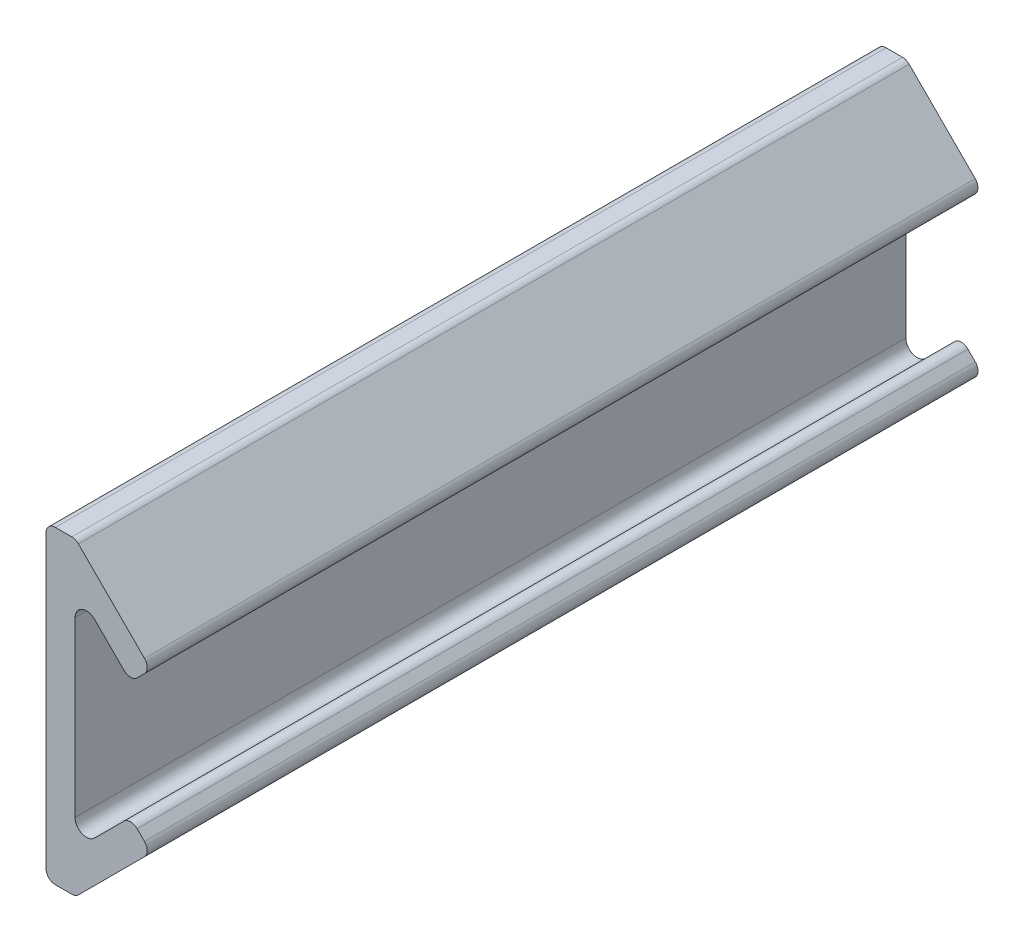
ISO-10303-21;
HEADER;
FILE_DESCRIPTION(('STEP AP214'),'2;1');
FILE_NAME('part.step','',(''),(''),'','','');
FILE_SCHEMA(('AUTOMOTIVE_DESIGN { 1 0 10303 214 1 1 1 1 }'));
ENDSEC;
DATA;
#1=APPLICATION_CONTEXT('core data for automotive mechanical design processes');
#2=APPLICATION_PROTOCOL_DEFINITION('international standard','automotive_design',2000,#1);
#3=PRODUCT_CONTEXT('',#1,'mechanical');
#4=PRODUCT('Part','Part','',(#3));
#5=PRODUCT_RELATED_PRODUCT_CATEGORY('part','',(#4));
#6=PRODUCT_DEFINITION_FORMATION('','',#4);
#7=PRODUCT_DEFINITION_CONTEXT('part definition',#1,'design');
#8=PRODUCT_DEFINITION('design','',#6,#7);
#9=PRODUCT_DEFINITION_SHAPE('','',#8);
#10=(LENGTH_UNIT() NAMED_UNIT(*) SI_UNIT(.MILLI.,.METRE.));
#11=(NAMED_UNIT(*) PLANE_ANGLE_UNIT() SI_UNIT($,.RADIAN.));
#12=(NAMED_UNIT(*) SI_UNIT($,.STERADIAN.) SOLID_ANGLE_UNIT());
#13=UNCERTAINTY_MEASURE_WITH_UNIT(LENGTH_MEASURE(1.E-05),#10,'distance_accuracy_value','');
#14=(GEOMETRIC_REPRESENTATION_CONTEXT(3) GLOBAL_UNCERTAINTY_ASSIGNED_CONTEXT((#13)) GLOBAL_UNIT_ASSIGNED_CONTEXT((#10,
#11,#12)) REPRESENTATION_CONTEXT('',''));
#15=CARTESIAN_POINT('',(0.,0.,0.));
#16=DIRECTION('',(0.,0.,1.));
#17=DIRECTION('',(1.,0.,0.));
#18=AXIS2_PLACEMENT_3D('',#15,#16,#17);
#19=CARTESIAN_POINT('',(2.5857864376269,-14.,80.));
#20=DIRECTION('',(0.,0.,-1.));
#21=DIRECTION('',(-1.,0.,0.));
#22=AXIS2_PLACEMENT_3D('',#19,#20,#21);
#23=CYLINDRICAL_SURFACE('',#22,0.899999999999999);
#24=CARTESIAN_POINT('',(2.5857864376269,-14.,0.));
#25=DIRECTION('',(0.,0.,1.));
#26=DIRECTION('',(1.,0.,0.));
#27=AXIS2_PLACEMENT_3D('',#24,#25,#26);
#28=CIRCLE('',#27,0.899999999999999);
#29=CARTESIAN_POINT('',(3.2221825406948,-14.6363961030679,0.));
#30=VERTEX_POINT('',#29);
#31=CARTESIAN_POINT('',(2.5857864376269,-14.9,0.));
#32=VERTEX_POINT('',#31);
#33=EDGE_CURVE('E204',#30,#32,#28,.F.);
#34=ORIENTED_EDGE('',*,*,#33,.F.);
#35=DIRECTION('',(0.,0.,-1.));
#36=VECTOR('',#35,1.);
#37=CARTESIAN_POINT('',(3.2221825406948,-14.6363961030679,80.));
#38=LINE('',#37,#36);
#39=CARTESIAN_POINT('',(3.2221825406948,-14.6363961030679,80.));
#40=VERTEX_POINT('',#39);
#41=EDGE_CURVE('E11',#40,#30,#38,.T.);
#42=ORIENTED_EDGE('',*,*,#41,.F.);
#43=CARTESIAN_POINT('',(2.5857864376269,-14.,80.));
#44=DIRECTION('',(0.,0.,1.));
#45=DIRECTION('',(1.,0.,0.));
#46=AXIS2_PLACEMENT_3D('',#43,#44,#45);
#47=CIRCLE('',#46,0.899999999999999);
#48=CARTESIAN_POINT('',(2.5857864376269,-14.9,80.));
#49=VERTEX_POINT('',#48);
#50=EDGE_CURVE('E255',#40,#49,#47,.F.);
#51=ORIENTED_EDGE('',*,*,#50,.T.);
#52=DIRECTION('',(0.,0.,-1.));
#53=VECTOR('',#52,1.);
#54=CARTESIAN_POINT('',(2.5857864376269,-14.9,80.));
#55=LINE('',#54,#53);
#56=EDGE_CURVE('E124',#49,#32,#55,.T.);
#57=ORIENTED_EDGE('',*,*,#56,.T.);
#58=EDGE_LOOP('',(#34,#42,#51,#57));
#59=FACE_BOUND('',#58,.T.);
#60=ADVANCED_FACE('F38',(#59),#23,.T.);
#61=CARTESIAN_POINT('',(8.92928932188135,-8.92928932188135,80.));
#62=DIRECTION('',(-0.707106781186547,0.707106781186548,0.));
#63=DIRECTION('',(-0.707106781186548,-0.707106781186547,0.));
#64=AXIS2_PLACEMENT_3D('',#61,#62,#63);
#65=PLANE('',#64);
#66=DIRECTION('',(0.707106781186548,0.707106781186547,0.));
#67=VECTOR('',#66,1.);
#68=CARTESIAN_POINT('',(8.92928932188135,-8.92928932188135,0.));
#69=LINE('',#68,#67);
#70=CARTESIAN_POINT('',(9.58614357137372,-8.27243507238897,0.));
#71=VERTEX_POINT('',#70);
#72=EDGE_CURVE('E207',#30,#71,#69,.T.);
#73=ORIENTED_EDGE('',*,*,#72,.T.);
#74=DIRECTION('',(0.,0.,-1.));
#75=VECTOR('',#74,1.);
#76=CARTESIAN_POINT('',(9.58614357137372,-8.27243507238897,80.));
#77=LINE('',#76,#75);
#78=CARTESIAN_POINT('',(9.58614357137372,-8.27243507238897,80.));
#79=VERTEX_POINT('',#78);
#80=EDGE_CURVE('E46',#79,#71,#77,.T.);
#81=ORIENTED_EDGE('',*,*,#80,.F.);
#82=DIRECTION('',(0.707106781186548,0.707106781186547,0.));
#83=VECTOR('',#82,1.);
#84=CARTESIAN_POINT('',(8.92928932188135,-8.92928932188135,80.));
#85=LINE('',#84,#83);
#86=EDGE_CURVE('E376',#40,#79,#85,.T.);
#87=ORIENTED_EDGE('',*,*,#86,.F.);
#88=ORIENTED_EDGE('',*,*,#41,.T.);
#89=EDGE_LOOP('',(#73,#81,#87,#88));
#90=FACE_BOUND('',#89,.T.);
#91=ADVANCED_FACE('F371',(#90),#65,.F.);
#92=CARTESIAN_POINT('',(8.94974746830583,-7.63603896932108,80.));
#93=DIRECTION('',(0.,0.,-1.));
#94=DIRECTION('',(-1.,0.,0.));
#95=AXIS2_PLACEMENT_3D('',#92,#93,#94);
#96=CYLINDRICAL_SURFACE('',#95,0.899999999999997);
#97=CARTESIAN_POINT('',(8.94974746830583,-7.63603896932108,0.));
#98=DIRECTION('',(0.,0.,1.));
#99=DIRECTION('',(1.,0.,0.));
#100=AXIS2_PLACEMENT_3D('',#97,#98,#99);
#101=CIRCLE('',#100,0.899999999999997);
#102=CARTESIAN_POINT('',(9.58614357137373,-6.99964286625319,0.));
#103=VERTEX_POINT('',#102);
#104=EDGE_CURVE('E209',#71,#103,#101,.T.);
#105=ORIENTED_EDGE('',*,*,#104,.T.);
#106=DIRECTION('',(0.,0.,-1.));
#107=VECTOR('',#106,1.);
#108=CARTESIAN_POINT('',(9.58614357137373,-6.99964286625319,80.));
#109=LINE('',#108,#107);
#110=CARTESIAN_POINT('',(9.58614357137373,-6.99964286625319,80.));
#111=VERTEX_POINT('',#110);
#112=EDGE_CURVE('E288',#111,#103,#109,.T.);
#113=ORIENTED_EDGE('',*,*,#112,.F.);
#114=CARTESIAN_POINT('',(8.94974746830583,-7.63603896932108,80.));
#115=DIRECTION('',(0.,0.,1.));
#116=DIRECTION('',(1.,0.,0.));
#117=AXIS2_PLACEMENT_3D('',#114,#115,#116);
#118=CIRCLE('',#117,0.899999999999997);
#119=EDGE_CURVE('E297',#79,#111,#118,.T.);
#120=ORIENTED_EDGE('',*,*,#119,.F.);
#121=ORIENTED_EDGE('',*,*,#80,.T.);
#122=EDGE_LOOP('',(#105,#113,#120,#121));
#123=FACE_BOUND('',#122,.T.);
#124=ADVANCED_FACE('F295',(#123),#96,.T.);
#125=CARTESIAN_POINT('',(1.29325035256027,1.29325035256027,80.));
#126=DIRECTION('',(-0.707106781186548,-0.707106781186548,0.));
#127=DIRECTION('',(0.707106781186548,-0.707106781186548,0.));
#128=AXIS2_PLACEMENT_3D('',#125,#126,#127);
#129=PLANE('',#128);
#130=DIRECTION('',(-0.707106781186548,0.707106781186548,0.));
#131=VECTOR('',#130,1.);
#132=CARTESIAN_POINT('',(1.29325035256027,1.29325035256027,0.));
#133=LINE('',#132,#131);
#134=CARTESIAN_POINT('',(8.87903679018718,-6.29253608506664,0.));
#135=VERTEX_POINT('',#134);
#136=EDGE_CURVE('E211',#103,#135,#133,.T.);
#137=ORIENTED_EDGE('',*,*,#136,.T.);
#138=DIRECTION('',(0.,0.,-1.));
#139=VECTOR('',#138,1.);
#140=CARTESIAN_POINT('',(8.87903679018718,-6.29253608506664,80.));
#141=LINE('',#140,#139);
#142=CARTESIAN_POINT('',(8.87903679018718,-6.29253608506664,80.));
#143=VERTEX_POINT('',#142);
#144=EDGE_CURVE('E285',#143,#135,#141,.T.);
#145=ORIENTED_EDGE('',*,*,#144,.F.);
#146=DIRECTION('',(-0.707106781186548,0.707106781186548,0.));
#147=VECTOR('',#146,1.);
#148=CARTESIAN_POINT('',(1.29325035256027,1.29325035256027,80.));
#149=LINE('',#148,#147);
#150=EDGE_CURVE('E316',#111,#143,#149,.T.);
#151=ORIENTED_EDGE('',*,*,#150,.F.);
#152=ORIENTED_EDGE('',*,*,#112,.T.);
#153=EDGE_LOOP('',(#137,#145,#151,#152));
#154=FACE_BOUND('',#153,.T.);
#155=ADVANCED_FACE('F307',(#154),#129,.F.);
#156=CARTESIAN_POINT('',(8.24264068711929,-6.92893218813453,80.));
#157=DIRECTION('',(0.,0.,-1.));
#158=DIRECTION('',(-1.,0.,0.));
#159=AXIS2_PLACEMENT_3D('',#156,#157,#158);
#160=CYLINDRICAL_SURFACE('',#159,0.900000000000001);
#161=CARTESIAN_POINT('',(8.24264068711929,-6.92893218813453,0.));
#162=DIRECTION('',(0.,0.,1.));
#163=DIRECTION('',(1.,0.,0.));
#164=AXIS2_PLACEMENT_3D('',#161,#162,#163);
#165=CIRCLE('',#164,0.900000000000001);
#166=CARTESIAN_POINT('',(7.60624458405139,-6.29253608506664,0.));
#167=VERTEX_POINT('',#166);
#168=EDGE_CURVE('E213',#135,#167,#165,.T.);
#169=ORIENTED_EDGE('',*,*,#168,.T.);
#170=DIRECTION('',(0.,0.,-1.));
#171=VECTOR('',#170,1.);
#172=CARTESIAN_POINT('',(7.60624458405139,-6.29253608506664,80.));
#173=LINE('',#172,#171);
#174=CARTESIAN_POINT('',(7.60624458405139,-6.29253608506664,80.));
#175=VERTEX_POINT('',#174);
#176=EDGE_CURVE('E282',#175,#167,#173,.T.);
#177=ORIENTED_EDGE('',*,*,#176,.F.);
#178=CARTESIAN_POINT('',(8.24264068711929,-6.92893218813453,80.));
#179=DIRECTION('',(0.,0.,1.));
#180=DIRECTION('',(1.,0.,0.));
#181=AXIS2_PLACEMENT_3D('',#178,#179,#180);
#182=CIRCLE('',#181,0.900000000000001);
#183=EDGE_CURVE('E313',#143,#175,#182,.T.);
#184=ORIENTED_EDGE('',*,*,#183,.F.);
#185=ORIENTED_EDGE('',*,*,#144,.T.);
#186=EDGE_LOOP('',(#169,#177,#184,#185));
#187=FACE_BOUND('',#186,.T.);
#188=ADVANCED_FACE('F311',(#187),#160,.T.);
#189=CARTESIAN_POINT('',(6.94939033455902,-6.94939033455902,80.));
#190=DIRECTION('',(0.707106781186548,-0.707106781186547,0.));
#191=DIRECTION('',(0.707106781186547,0.707106781186548,0.));
#192=AXIS2_PLACEMENT_3D('',#189,#190,#191);
#193=PLANE('',#192);
#194=DIRECTION('',(-0.707106781186547,-0.707106781186548,0.));
#195=VECTOR('',#194,1.);
#196=CARTESIAN_POINT('',(6.94939033455902,-6.94939033455902,0.));
#197=LINE('',#196,#195);
#198=CARTESIAN_POINT('',(4.77781745930521,-9.12096320981283,0.));
#199=VERTEX_POINT('',#198);
#200=EDGE_CURVE('E215',#167,#199,#197,.T.);
#201=ORIENTED_EDGE('',*,*,#200,.T.);
#202=DIRECTION('',(0.,0.,-1.));
#203=VECTOR('',#202,1.);
#204=CARTESIAN_POINT('',(4.77781745930521,-9.12096320981283,80.));
#205=LINE('',#204,#203);
#206=CARTESIAN_POINT('',(4.77781745930521,-9.12096320981283,80.));
#207=VERTEX_POINT('',#206);
#208=EDGE_CURVE('E280',#207,#199,#205,.T.);
#209=ORIENTED_EDGE('',*,*,#208,.F.);
#210=DIRECTION('',(-0.707106781186547,-0.707106781186548,0.));
#211=VECTOR('',#210,1.);
#212=CARTESIAN_POINT('',(6.94939033455902,-6.94939033455902,80.));
#213=LINE('',#212,#211);
#214=EDGE_CURVE('E315',#175,#207,#213,.T.);
#215=ORIENTED_EDGE('',*,*,#214,.F.);
#216=ORIENTED_EDGE('',*,*,#176,.T.);
#217=EDGE_LOOP('',(#201,#209,#215,#216));
#218=FACE_BOUND('',#217,.T.);
#219=ADVANCED_FACE('F524',(#218),#193,.F.);
#220=CARTESIAN_POINT('',(4.,-8.34314575050762,80.));
#221=DIRECTION('',(0.,0.,-1.));
#222=DIRECTION('',(-1.,0.,0.));
#223=AXIS2_PLACEMENT_3D('',#220,#221,#222);
#224=CYLINDRICAL_SURFACE('',#223,1.1);
#225=CARTESIAN_POINT('',(4.,-8.34314575050762,0.));
#226=DIRECTION('',(0.,0.,1.));
#227=DIRECTION('',(1.,0.,0.));
#228=AXIS2_PLACEMENT_3D('',#225,#226,#227);
#229=CIRCLE('',#228,1.1);
#230=CARTESIAN_POINT('',(2.9,-8.34314575050762,0.));
#231=VERTEX_POINT('',#230);
#232=EDGE_CURVE('E218',#231,#199,#229,.T.);
#233=ORIENTED_EDGE('',*,*,#232,.F.);
#234=DIRECTION('',(0.,0.,-1.));
#235=VECTOR('',#234,1.);
#236=CARTESIAN_POINT('',(2.9,-8.34314575050762,80.));
#237=LINE('',#236,#235);
#238=CARTESIAN_POINT('',(2.9,-8.34314575050762,80.));
#239=VERTEX_POINT('',#238);
#240=EDGE_CURVE('E278',#239,#231,#237,.T.);
#241=ORIENTED_EDGE('',*,*,#240,.F.);
#242=CARTESIAN_POINT('',(4.,-8.34314575050762,80.));
#243=DIRECTION('',(0.,0.,1.));
#244=DIRECTION('',(1.,0.,0.));
#245=AXIS2_PLACEMENT_3D('',#242,#243,#244);
#246=CIRCLE('',#245,1.1);
#247=EDGE_CURVE('E318',#239,#207,#246,.T.);
#248=ORIENTED_EDGE('',*,*,#247,.T.);
#249=ORIENTED_EDGE('',*,*,#208,.T.);
#250=EDGE_LOOP('',(#233,#241,#248,#249));
#251=FACE_BOUND('',#250,.T.);
#252=ADVANCED_FACE('F513',(#251),#224,.F.);
#253=CARTESIAN_POINT('',(2.9,0.,80.));
#254=DIRECTION('',(-1.,0.,0.));
#255=DIRECTION('',(0.,-1.,0.));
#256=AXIS2_PLACEMENT_3D('',#253,#254,#255);
#257=PLANE('',#256);
#258=DIRECTION('',(0.,1.,0.));
#259=VECTOR('',#258,1.);
#260=CARTESIAN_POINT('',(2.9,0.,0.));
#261=LINE('',#260,#259);
#262=CARTESIAN_POINT('',(2.9,8.34314575050762,0.));
#263=VERTEX_POINT('',#262);
#264=EDGE_CURVE('E221',#231,#263,#261,.T.);
#265=ORIENTED_EDGE('',*,*,#264,.T.);
#266=DIRECTION('',(0.,0.,-1.));
#267=VECTOR('',#266,1.);
#268=CARTESIAN_POINT('',(2.9,8.34314575050762,80.));
#269=LINE('',#268,#267);
#270=CARTESIAN_POINT('',(2.9,8.34314575050762,80.));
#271=VERTEX_POINT('',#270);
#272=EDGE_CURVE('E275',#271,#263,#269,.T.);
#273=ORIENTED_EDGE('',*,*,#272,.F.);
#274=DIRECTION('',(0.,1.,0.));
#275=VECTOR('',#274,1.);
#276=CARTESIAN_POINT('',(2.9,0.,80.));
#277=LINE('',#276,#275);
#278=EDGE_CURVE('E325',#239,#271,#277,.T.);
#279=ORIENTED_EDGE('',*,*,#278,.F.);
#280=ORIENTED_EDGE('',*,*,#240,.T.);
#281=EDGE_LOOP('',(#265,#273,#279,#280));
#282=FACE_BOUND('',#281,.T.);
#283=ADVANCED_FACE('F502',(#282),#257,.F.);
#284=CARTESIAN_POINT('',(4.,8.34314575050762,80.));
#285=DIRECTION('',(0.,0.,-1.));
#286=DIRECTION('',(-1.,0.,0.));
#287=AXIS2_PLACEMENT_3D('',#284,#285,#286);
#288=CYLINDRICAL_SURFACE('',#287,1.1);
#289=CARTESIAN_POINT('',(4.,8.34314575050762,0.));
#290=DIRECTION('',(0.,0.,1.));
#291=DIRECTION('',(1.,0.,0.));
#292=AXIS2_PLACEMENT_3D('',#289,#290,#291);
#293=CIRCLE('',#292,1.1);
#294=CARTESIAN_POINT('',(4.7778174593052,9.12096320981283,0.));
#295=VERTEX_POINT('',#294);
#296=EDGE_CURVE('E223',#263,#295,#293,.F.);
#297=ORIENTED_EDGE('',*,*,#296,.T.);
#298=DIRECTION('',(0.,0.,-1.));
#299=VECTOR('',#298,1.);
#300=CARTESIAN_POINT('',(4.7778174593052,9.12096320981283,80.));
#301=LINE('',#300,#299);
#302=CARTESIAN_POINT('',(4.7778174593052,9.12096320981283,80.));
#303=VERTEX_POINT('',#302);
#304=EDGE_CURVE('E273',#303,#295,#301,.T.);
#305=ORIENTED_EDGE('',*,*,#304,.F.);
#306=CARTESIAN_POINT('',(4.,8.34314575050762,80.));
#307=DIRECTION('',(0.,0.,1.));
#308=DIRECTION('',(1.,0.,0.));
#309=AXIS2_PLACEMENT_3D('',#306,#307,#308);
#310=CIRCLE('',#309,1.1);
#311=EDGE_CURVE('E327',#271,#303,#310,.F.);
#312=ORIENTED_EDGE('',*,*,#311,.F.);
#313=ORIENTED_EDGE('',*,*,#272,.T.);
#314=EDGE_LOOP('',(#297,#305,#312,#313));
#315=FACE_BOUND('',#314,.T.);
#316=ADVANCED_FACE('F491',(#315),#288,.F.);
#317=CARTESIAN_POINT('',(6.94939033455901,6.94939033455902,80.));
#318=DIRECTION('',(-0.707106781186547,-0.707106781186548,0.));
#319=DIRECTION('',(0.707106781186548,-0.707106781186547,0.));
#320=AXIS2_PLACEMENT_3D('',#317,#318,#319);
#321=PLANE('',#320);
#322=DIRECTION('',(-0.707106781186548,0.707106781186547,0.));
#323=VECTOR('',#322,1.);
#324=CARTESIAN_POINT('',(6.94939033455901,6.94939033455902,0.));
#325=LINE('',#324,#323);
#326=CARTESIAN_POINT('',(7.60624458405139,6.29253608506664,0.));
#327=VERTEX_POINT('',#326);
#328=EDGE_CURVE('E226',#327,#295,#325,.T.);
#329=ORIENTED_EDGE('',*,*,#328,.F.);
#330=DIRECTION('',(0.,0.,-1.));
#331=VECTOR('',#330,1.);
#332=CARTESIAN_POINT('',(7.60624458405139,6.29253608506664,80.));
#333=LINE('',#332,#331);
#334=CARTESIAN_POINT('',(7.60624458405139,6.29253608506664,80.));
#335=VERTEX_POINT('',#334);
#336=EDGE_CURVE('E271',#335,#327,#333,.T.);
#337=ORIENTED_EDGE('',*,*,#336,.F.);
#338=DIRECTION('',(-0.707106781186548,0.707106781186547,0.));
#339=VECTOR('',#338,1.);
#340=CARTESIAN_POINT('',(6.94939033455901,6.94939033455902,80.));
#341=LINE('',#340,#339);
#342=EDGE_CURVE('E329',#335,#303,#341,.T.);
#343=ORIENTED_EDGE('',*,*,#342,.T.);
#344=ORIENTED_EDGE('',*,*,#304,.T.);
#345=EDGE_LOOP('',(#329,#337,#343,#344));
#346=FACE_BOUND('',#345,.T.);
#347=ADVANCED_FACE('F480',(#346),#321,.T.);
#348=CARTESIAN_POINT('',(8.24264068711929,6.92893218813453,80.));
#349=DIRECTION('',(0.,0.,-1.));
#350=DIRECTION('',(-1.,0.,0.));
#351=AXIS2_PLACEMENT_3D('',#348,#349,#350);
#352=CYLINDRICAL_SURFACE('',#351,0.900000000000001);
#353=CARTESIAN_POINT('',(8.24264068711929,6.92893218813453,0.));
#354=DIRECTION('',(0.,0.,1.));
#355=DIRECTION('',(1.,0.,0.));
#356=AXIS2_PLACEMENT_3D('',#353,#354,#355);
#357=CIRCLE('',#356,0.900000000000001);
#358=CARTESIAN_POINT('',(8.87903679018718,6.29253608506664,0.));
#359=VERTEX_POINT('',#358);
#360=EDGE_CURVE('E229',#359,#327,#357,.F.);
#361=ORIENTED_EDGE('',*,*,#360,.F.);
#362=DIRECTION('',(0.,0.,-1.));
#363=VECTOR('',#362,1.);
#364=CARTESIAN_POINT('',(8.87903679018718,6.29253608506664,80.));
#365=LINE('',#364,#363);
#366=CARTESIAN_POINT('',(8.87903679018718,6.29253608506664,80.));
#367=VERTEX_POINT('',#366);
#368=EDGE_CURVE('E269',#367,#359,#365,.T.);
#369=ORIENTED_EDGE('',*,*,#368,.F.);
#370=CARTESIAN_POINT('',(8.24264068711929,6.92893218813453,80.));
#371=DIRECTION('',(0.,0.,1.));
#372=DIRECTION('',(1.,0.,0.));
#373=AXIS2_PLACEMENT_3D('',#370,#371,#372);
#374=CIRCLE('',#373,0.900000000000001);
#375=EDGE_CURVE('E332',#367,#335,#374,.F.);
#376=ORIENTED_EDGE('',*,*,#375,.T.);
#377=ORIENTED_EDGE('',*,*,#336,.T.);
#378=EDGE_LOOP('',(#361,#369,#376,#377));
#379=FACE_BOUND('',#378,.T.);
#380=ADVANCED_FACE('F469',(#379),#352,.T.);
#381=CARTESIAN_POINT('',(1.29325035256028,-1.29325035256028,80.));
#382=DIRECTION('',(0.707106781186548,-0.707106781186547,0.));
#383=DIRECTION('',(0.707106781186547,0.707106781186548,0.));
#384=AXIS2_PLACEMENT_3D('',#381,#382,#383);
#385=PLANE('',#384);
#386=DIRECTION('',(-0.707106781186547,-0.707106781186548,0.));
#387=VECTOR('',#386,1.);
#388=CARTESIAN_POINT('',(1.29325035256028,-1.29325035256028,0.));
#389=LINE('',#388,#387);
#390=CARTESIAN_POINT('',(9.58614357137373,6.99964286625319,0.));
#391=VERTEX_POINT('',#390);
#392=EDGE_CURVE('E232',#391,#359,#389,.T.);
#393=ORIENTED_EDGE('',*,*,#392,.F.);
#394=DIRECTION('',(0.,0.,-1.));
#395=VECTOR('',#394,1.);
#396=CARTESIAN_POINT('',(9.58614357137373,6.99964286625319,80.));
#397=LINE('',#396,#395);
#398=CARTESIAN_POINT('',(9.58614357137373,6.99964286625319,80.));
#399=VERTEX_POINT('',#398);
#400=EDGE_CURVE('E267',#399,#391,#397,.T.);
#401=ORIENTED_EDGE('',*,*,#400,.F.);
#402=DIRECTION('',(-0.707106781186547,-0.707106781186548,0.));
#403=VECTOR('',#402,1.);
#404=CARTESIAN_POINT('',(1.29325035256028,-1.29325035256028,80.));
#405=LINE('',#404,#403);
#406=EDGE_CURVE('E335',#399,#367,#405,.T.);
#407=ORIENTED_EDGE('',*,*,#406,.T.);
#408=ORIENTED_EDGE('',*,*,#368,.T.);
#409=EDGE_LOOP('',(#393,#401,#407,#408));
#410=FACE_BOUND('',#409,.T.);
#411=ADVANCED_FACE('F458',(#410),#385,.T.);
#412=CARTESIAN_POINT('',(8.94974746830583,7.63603896932108,80.));
#413=DIRECTION('',(0.,0.,-1.));
#414=DIRECTION('',(-1.,0.,0.));
#415=AXIS2_PLACEMENT_3D('',#412,#413,#414);
#416=CYLINDRICAL_SURFACE('',#415,0.9);
#417=CARTESIAN_POINT('',(8.94974746830583,7.63603896932108,0.));
#418=DIRECTION('',(0.,0.,1.));
#419=DIRECTION('',(1.,0.,0.));
#420=AXIS2_PLACEMENT_3D('',#417,#418,#419);
#421=CIRCLE('',#420,0.9);
#422=CARTESIAN_POINT('',(9.58614357137373,8.27243507238897,0.));
#423=VERTEX_POINT('',#422);
#424=EDGE_CURVE('E235',#423,#391,#421,.F.);
#425=ORIENTED_EDGE('',*,*,#424,.F.);
#426=DIRECTION('',(0.,0.,-1.));
#427=VECTOR('',#426,1.);
#428=CARTESIAN_POINT('',(9.58614357137373,8.27243507238897,80.));
#429=LINE('',#428,#427);
#430=CARTESIAN_POINT('',(9.58614357137373,8.27243507238897,80.));
#431=VERTEX_POINT('',#430);
#432=EDGE_CURVE('E265',#431,#423,#429,.T.);
#433=ORIENTED_EDGE('',*,*,#432,.F.);
#434=CARTESIAN_POINT('',(8.94974746830583,7.63603896932108,80.));
#435=DIRECTION('',(0.,0.,1.));
#436=DIRECTION('',(1.,0.,0.));
#437=AXIS2_PLACEMENT_3D('',#434,#435,#436);
#438=CIRCLE('',#437,0.9);
#439=EDGE_CURVE('E338',#431,#399,#438,.F.);
#440=ORIENTED_EDGE('',*,*,#439,.T.);
#441=ORIENTED_EDGE('',*,*,#400,.T.);
#442=EDGE_LOOP('',(#425,#433,#440,#441));
#443=FACE_BOUND('',#442,.T.);
#444=ADVANCED_FACE('F447',(#443),#416,.T.);
#445=CARTESIAN_POINT('',(8.92928932188134,8.92928932188136,80.));
#446=DIRECTION('',(0.707106781186547,0.707106781186548,0.));
#447=DIRECTION('',(-0.707106781186548,0.707106781186547,0.));
#448=AXIS2_PLACEMENT_3D('',#445,#446,#447);
#449=PLANE('',#448);
#450=DIRECTION('',(0.707106781186548,-0.707106781186547,0.));
#451=VECTOR('',#450,1.);
#452=CARTESIAN_POINT('',(8.92928932188134,8.92928932188136,0.));
#453=LINE('',#452,#451);
#454=CARTESIAN_POINT('',(3.2221825406948,14.6363961030679,0.));
#455=VERTEX_POINT('',#454);
#456=EDGE_CURVE('E238',#455,#423,#453,.T.);
#457=ORIENTED_EDGE('',*,*,#456,.F.);
#458=DIRECTION('',(0.,0.,-1.));
#459=VECTOR('',#458,1.);
#460=CARTESIAN_POINT('',(3.2221825406948,14.6363961030679,80.));
#461=LINE('',#460,#459);
#462=CARTESIAN_POINT('',(3.2221825406948,14.6363961030679,80.));
#463=VERTEX_POINT('',#462);
#464=EDGE_CURVE('E263',#463,#455,#461,.T.);
#465=ORIENTED_EDGE('',*,*,#464,.F.);
#466=DIRECTION('',(0.707106781186548,-0.707106781186547,0.));
#467=VECTOR('',#466,1.);
#468=CARTESIAN_POINT('',(8.92928932188134,8.92928932188136,80.));
#469=LINE('',#468,#467);
#470=EDGE_CURVE('E341',#463,#431,#469,.T.);
#471=ORIENTED_EDGE('',*,*,#470,.T.);
#472=ORIENTED_EDGE('',*,*,#432,.T.);
#473=EDGE_LOOP('',(#457,#465,#471,#472));
#474=FACE_BOUND('',#473,.T.);
#475=ADVANCED_FACE('F437',(#474),#449,.T.);
#476=CARTESIAN_POINT('',(2.5857864376269,14.,80.));
#477=DIRECTION('',(0.,0.,-1.));
#478=DIRECTION('',(-1.,0.,0.));
#479=AXIS2_PLACEMENT_3D('',#476,#477,#478);
#480=CYLINDRICAL_SURFACE('',#479,0.899999999999999);
#481=CARTESIAN_POINT('',(2.5857864376269,14.,0.));
#482=DIRECTION('',(0.,0.,1.));
#483=DIRECTION('',(1.,0.,0.));
#484=AXIS2_PLACEMENT_3D('',#481,#482,#483);
#485=CIRCLE('',#484,0.899999999999999);
#486=CARTESIAN_POINT('',(2.5857864376269,14.9,0.));
#487=VERTEX_POINT('',#486);
#488=EDGE_CURVE('E241',#455,#487,#485,.T.);
#489=ORIENTED_EDGE('',*,*,#488,.T.);
#490=DIRECTION('',(0.,0.,-1.));
#491=VECTOR('',#490,1.);
#492=CARTESIAN_POINT('',(2.5857864376269,14.9,80.));
#493=LINE('',#492,#491);
#494=CARTESIAN_POINT('',(2.5857864376269,14.9,80.));
#495=VERTEX_POINT('',#494);
#496=EDGE_CURVE('E261',#495,#487,#493,.T.);
#497=ORIENTED_EDGE('',*,*,#496,.F.);
#498=CARTESIAN_POINT('',(2.5857864376269,14.,80.));
#499=DIRECTION('',(0.,0.,1.));
#500=DIRECTION('',(1.,0.,0.));
#501=AXIS2_PLACEMENT_3D('',#498,#499,#500);
#502=CIRCLE('',#501,0.899999999999999);
#503=EDGE_CURVE('E344',#463,#495,#502,.T.);
#504=ORIENTED_EDGE('',*,*,#503,.F.);
#505=ORIENTED_EDGE('',*,*,#464,.T.);
#506=EDGE_LOOP('',(#489,#497,#504,#505));
#507=FACE_BOUND('',#506,.T.);
#508=ADVANCED_FACE('F356',(#507),#480,.T.);
#509=CARTESIAN_POINT('',(0.,14.9,80.));
#510=DIRECTION('',(0.,1.,0.));
#511=DIRECTION('',(0.,0.,1.));
#512=AXIS2_PLACEMENT_3D('',#509,#510,#511);
#513=PLANE('',#512);
#514=DIRECTION('',(1.,0.,0.));
#515=VECTOR('',#514,1.);
#516=CARTESIAN_POINT('',(0.,14.9,0.));
#517=LINE('',#516,#515);
#518=CARTESIAN_POINT('',(1.00000000000001,14.9,0.));
#519=VERTEX_POINT('',#518);
#520=EDGE_CURVE('E244',#519,#487,#517,.T.);
#521=ORIENTED_EDGE('',*,*,#520,.F.);
#522=DIRECTION('',(0.,0.,-1.));
#523=VECTOR('',#522,1.);
#524=CARTESIAN_POINT('',(1.00000000000001,14.9,80.));
#525=LINE('',#524,#523);
#526=CARTESIAN_POINT('',(1.00000000000001,14.9,80.));
#527=VERTEX_POINT('',#526);
#528=EDGE_CURVE('E259',#527,#519,#525,.T.);
#529=ORIENTED_EDGE('',*,*,#528,.F.);
#530=DIRECTION('',(1.,0.,0.));
#531=VECTOR('',#530,1.);
#532=CARTESIAN_POINT('',(0.,14.9,80.));
#533=LINE('',#532,#531);
#534=EDGE_CURVE('E346',#527,#495,#533,.T.);
#535=ORIENTED_EDGE('',*,*,#534,.T.);
#536=ORIENTED_EDGE('',*,*,#496,.T.);
#537=EDGE_LOOP('',(#521,#529,#535,#536));
#538=FACE_BOUND('',#537,.T.);
#539=ADVANCED_FACE('F350',(#538),#513,.T.);
#540=CARTESIAN_POINT('',(1.,14.,80.));
#541=DIRECTION('',(0.,0.,-1.));
#542=DIRECTION('',(-1.,0.,0.));
#543=AXIS2_PLACEMENT_3D('',#540,#541,#542);
#544=CYLINDRICAL_SURFACE('',#543,0.9);
#545=CARTESIAN_POINT('',(1.,14.,0.));
#546=DIRECTION('',(0.,0.,1.));
#547=DIRECTION('',(1.,0.,0.));
#548=AXIS2_PLACEMENT_3D('',#545,#546,#547);
#549=CIRCLE('',#548,0.9);
#550=CARTESIAN_POINT('',(0.1,14.,0.));
#551=VERTEX_POINT('',#550);
#552=EDGE_CURVE('E247',#519,#551,#549,.T.);
#553=ORIENTED_EDGE('',*,*,#552,.T.);
#554=DIRECTION('',(0.,0.,-1.));
#555=VECTOR('',#554,1.);
#556=CARTESIAN_POINT('',(0.1,14.,80.));
#557=LINE('',#556,#555);
#558=CARTESIAN_POINT('',(0.1,14.,80.));
#559=VERTEX_POINT('',#558);
#560=EDGE_CURVE('E190',#559,#551,#557,.T.);
#561=ORIENTED_EDGE('',*,*,#560,.F.);
#562=CARTESIAN_POINT('',(1.,14.,80.));
#563=DIRECTION('',(0.,0.,1.));
#564=DIRECTION('',(1.,0.,0.));
#565=AXIS2_PLACEMENT_3D('',#562,#563,#564);
#566=CIRCLE('',#565,0.9);
#567=EDGE_CURVE('E196',#527,#559,#566,.T.);
#568=ORIENTED_EDGE('',*,*,#567,.F.);
#569=ORIENTED_EDGE('',*,*,#528,.T.);
#570=EDGE_LOOP('',(#553,#561,#568,#569));
#571=FACE_BOUND('',#570,.T.);
#572=ADVANCED_FACE('F361',(#571),#544,.T.);
#573=CARTESIAN_POINT('',(0.1,0.,80.));
#574=DIRECTION('',(-1.,0.,0.));
#575=DIRECTION('',(0.,-1.,0.));
#576=AXIS2_PLACEMENT_3D('',#573,#574,#575);
#577=PLANE('',#576);
#578=DIRECTION('',(0.,1.,0.));
#579=VECTOR('',#578,1.);
#580=CARTESIAN_POINT('',(0.1,0.,0.));
#581=LINE('',#580,#579);
#582=CARTESIAN_POINT('',(0.1,-14.,0.));
#583=VERTEX_POINT('',#582);
#584=EDGE_CURVE('E185',#583,#551,#581,.T.);
#585=ORIENTED_EDGE('',*,*,#584,.F.);
#586=DIRECTION('',(0.,0.,-1.));
#587=VECTOR('',#586,1.);
#588=CARTESIAN_POINT('',(0.1,-14.,80.));
#589=LINE('',#588,#587);
#590=CARTESIAN_POINT('',(0.1,-14.,80.));
#591=VERTEX_POINT('',#590);
#592=EDGE_CURVE('E180',#591,#583,#589,.T.);
#593=ORIENTED_EDGE('',*,*,#592,.F.);
#594=DIRECTION('',(0.,1.,0.));
#595=VECTOR('',#594,1.);
#596=CARTESIAN_POINT('',(0.1,0.,80.));
#597=LINE('',#596,#595);
#598=EDGE_CURVE('E183',#591,#559,#597,.T.);
#599=ORIENTED_EDGE('',*,*,#598,.T.);
#600=ORIENTED_EDGE('',*,*,#560,.T.);
#601=EDGE_LOOP('',(#585,#593,#599,#600));
#602=FACE_BOUND('',#601,.T.);
#603=ADVANCED_FACE('F182',(#602),#577,.T.);
#604=CARTESIAN_POINT('',(1.,-14.,80.));
#605=DIRECTION('',(0.,0.,-1.));
#606=DIRECTION('',(-1.,0.,0.));
#607=AXIS2_PLACEMENT_3D('',#604,#605,#606);
#608=CYLINDRICAL_SURFACE('',#607,0.9);
#609=CARTESIAN_POINT('',(1.,-14.,0.));
#610=DIRECTION('',(0.,0.,1.));
#611=DIRECTION('',(1.,0.,0.));
#612=AXIS2_PLACEMENT_3D('',#609,#610,#611);
#613=CIRCLE('',#612,0.9);
#614=CARTESIAN_POINT('',(1.00000000000001,-14.9,0.));
#615=VERTEX_POINT('',#614);
#616=EDGE_CURVE('E251',#615,#583,#613,.F.);
#617=ORIENTED_EDGE('',*,*,#616,.F.);
#618=DIRECTION('',(0.,0.,-1.));
#619=VECTOR('',#618,1.);
#620=CARTESIAN_POINT('',(1.00000000000001,-14.9,80.));
#621=LINE('',#620,#619);
#622=CARTESIAN_POINT('',(1.00000000000001,-14.9,80.));
#623=VERTEX_POINT('',#622);
#624=EDGE_CURVE('E117',#623,#615,#621,.T.);
#625=ORIENTED_EDGE('',*,*,#624,.F.);
#626=CARTESIAN_POINT('',(1.,-14.,80.));
#627=DIRECTION('',(0.,0.,1.));
#628=DIRECTION('',(1.,0.,0.));
#629=AXIS2_PLACEMENT_3D('',#626,#627,#628);
#630=CIRCLE('',#629,0.9);
#631=EDGE_CURVE('E193',#623,#591,#630,.F.);
#632=ORIENTED_EDGE('',*,*,#631,.T.);
#633=ORIENTED_EDGE('',*,*,#592,.T.);
#634=EDGE_LOOP('',(#617,#625,#632,#633));
#635=FACE_BOUND('',#634,.T.);
#636=ADVANCED_FACE('F199',(#635),#608,.T.);
#637=CARTESIAN_POINT('',(0.,-14.9,80.));
#638=DIRECTION('',(0.,1.,0.));
#639=DIRECTION('',(0.,0.,1.));
#640=AXIS2_PLACEMENT_3D('',#637,#638,#639);
#641=PLANE('',#640);
#642=DIRECTION('',(1.,0.,0.));
#643=VECTOR('',#642,1.);
#644=CARTESIAN_POINT('',(0.,-14.9,0.));
#645=LINE('',#644,#643);
#646=EDGE_CURVE('E253',#615,#32,#645,.T.);
#647=ORIENTED_EDGE('',*,*,#646,.T.);
#648=ORIENTED_EDGE('',*,*,#56,.F.);
#649=DIRECTION('',(1.,0.,0.));
#650=VECTOR('',#649,1.);
#651=CARTESIAN_POINT('',(0.,-14.9,80.));
#652=LINE('',#651,#650);
#653=EDGE_CURVE('E54',#623,#49,#652,.T.);
#654=ORIENTED_EDGE('',*,*,#653,.F.);
#655=ORIENTED_EDGE('',*,*,#624,.T.);
#656=EDGE_LOOP('',(#647,#648,#654,#655));
#657=FACE_BOUND('',#656,.T.);
#658=ADVANCED_FACE('F375',(#657),#641,.F.);
#659=CARTESIAN_POINT('',(0.,0.,80.));
#660=DIRECTION('',(0.,0.,1.));
#661=DIRECTION('',(1.,0.,0.));
#662=AXIS2_PLACEMENT_3D('',#659,#660,#661);
#663=PLANE('',#662);
#664=ORIENTED_EDGE('',*,*,#50,.F.);
#665=ORIENTED_EDGE('',*,*,#86,.T.);
#666=ORIENTED_EDGE('',*,*,#119,.T.);
#667=ORIENTED_EDGE('',*,*,#150,.T.);
#668=ORIENTED_EDGE('',*,*,#183,.T.);
#669=ORIENTED_EDGE('',*,*,#214,.T.);
#670=ORIENTED_EDGE('',*,*,#247,.F.);
#671=ORIENTED_EDGE('',*,*,#278,.T.);
#672=ORIENTED_EDGE('',*,*,#311,.T.);
#673=ORIENTED_EDGE('',*,*,#342,.F.);
#674=ORIENTED_EDGE('',*,*,#375,.F.);
#675=ORIENTED_EDGE('',*,*,#406,.F.);
#676=ORIENTED_EDGE('',*,*,#439,.F.);
#677=ORIENTED_EDGE('',*,*,#470,.F.);
#678=ORIENTED_EDGE('',*,*,#503,.T.);
#679=ORIENTED_EDGE('',*,*,#534,.F.);
#680=ORIENTED_EDGE('',*,*,#567,.T.);
#681=ORIENTED_EDGE('',*,*,#598,.F.);
#682=ORIENTED_EDGE('',*,*,#631,.F.);
#683=ORIENTED_EDGE('',*,*,#653,.T.);
#684=EDGE_LOOP('',(#664,#665,#666,#667,#668,#669,#670,#671,#672,#673,#674,#675,#676,#677,#678,
#679,#680,#681,#682,#683));
#685=FACE_BOUND('',#684,.T.);
#686=ADVANCED_FACE('F192',(#685),#663,.T.);
#687=CARTESIAN_POINT('',(0.,0.,0.));
#688=DIRECTION('',(0.,0.,1.));
#689=DIRECTION('',(1.,0.,0.));
#690=AXIS2_PLACEMENT_3D('',#687,#688,#689);
#691=PLANE('',#690);
#692=ORIENTED_EDGE('',*,*,#33,.T.);
#693=ORIENTED_EDGE('',*,*,#646,.F.);
#694=ORIENTED_EDGE('',*,*,#616,.T.);
#695=ORIENTED_EDGE('',*,*,#584,.T.);
#696=ORIENTED_EDGE('',*,*,#552,.F.);
#697=ORIENTED_EDGE('',*,*,#520,.T.);
#698=ORIENTED_EDGE('',*,*,#488,.F.);
#699=ORIENTED_EDGE('',*,*,#456,.T.);
#700=ORIENTED_EDGE('',*,*,#424,.T.);
#701=ORIENTED_EDGE('',*,*,#392,.T.);
#702=ORIENTED_EDGE('',*,*,#360,.T.);
#703=ORIENTED_EDGE('',*,*,#328,.T.);
#704=ORIENTED_EDGE('',*,*,#296,.F.);
#705=ORIENTED_EDGE('',*,*,#264,.F.);
#706=ORIENTED_EDGE('',*,*,#232,.T.);
#707=ORIENTED_EDGE('',*,*,#200,.F.);
#708=ORIENTED_EDGE('',*,*,#168,.F.);
#709=ORIENTED_EDGE('',*,*,#136,.F.);
#710=ORIENTED_EDGE('',*,*,#104,.F.);
#711=ORIENTED_EDGE('',*,*,#72,.F.);
#712=EDGE_LOOP('',(#692,#693,#694,#695,#696,#697,#698,#699,#700,#701,#702,#703,#704,#705,#706,
#707,#708,#709,#710,#711));
#713=FACE_BOUND('',#712,.T.);
#714=ADVANCED_FACE('F302',(#713),#691,.F.);
#715=CLOSED_SHELL('',(#60,#91,#124,#155,#188,#219,#252,#283,#316,#347,#380,#411,#444,#475,#508,
#539,#572,#603,#636,#658,#686,#714));
#716=MANIFOLD_SOLID_BREP('B2',#715);
#717=ADVANCED_BREP_SHAPE_REPRESENTATION('',(#18,#716),#14);
#718=SHAPE_DEFINITION_REPRESENTATION(#9,#717);
ENDSEC;
END-ISO-10303-21;
